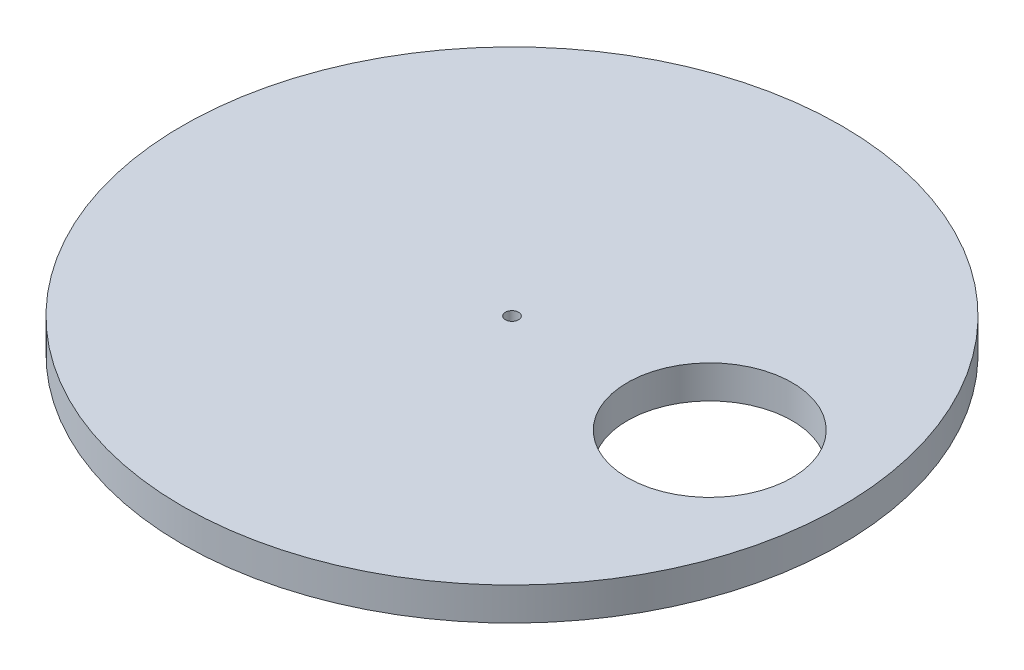
ISO-10303-21;
HEADER;
FILE_DESCRIPTION(('STEP AP214'),'2;1');
FILE_NAME('part.step','',(''),(''),'','','');
FILE_SCHEMA(('AUTOMOTIVE_DESIGN { 1 0 10303 214 1 1 1 1 }'));
ENDSEC;
DATA;
#1=APPLICATION_CONTEXT('core data for automotive mechanical design processes');
#2=APPLICATION_PROTOCOL_DEFINITION('international standard','automotive_design',2000,#1);
#3=PRODUCT_CONTEXT('',#1,'mechanical');
#4=PRODUCT('Part','Part','',(#3));
#5=PRODUCT_RELATED_PRODUCT_CATEGORY('part','',(#4));
#6=PRODUCT_DEFINITION_FORMATION('','',#4);
#7=PRODUCT_DEFINITION_CONTEXT('part definition',#1,'design');
#8=PRODUCT_DEFINITION('design','',#6,#7);
#9=PRODUCT_DEFINITION_SHAPE('','',#8);
#10=(LENGTH_UNIT() NAMED_UNIT(*) SI_UNIT(.MILLI.,.METRE.));
#11=(NAMED_UNIT(*) PLANE_ANGLE_UNIT() SI_UNIT($,.RADIAN.));
#12=(NAMED_UNIT(*) SI_UNIT($,.STERADIAN.) SOLID_ANGLE_UNIT());
#13=UNCERTAINTY_MEASURE_WITH_UNIT(LENGTH_MEASURE(1.E-05),#10,'distance_accuracy_value','');
#14=(GEOMETRIC_REPRESENTATION_CONTEXT(3) GLOBAL_UNCERTAINTY_ASSIGNED_CONTEXT((#13)) GLOBAL_UNIT_ASSIGNED_CONTEXT((#10,
#11,#12)) REPRESENTATION_CONTEXT('',''));
#15=CARTESIAN_POINT('',(0.,0.,0.));
#16=DIRECTION('',(0.,0.,1.));
#17=DIRECTION('',(1.,0.,0.));
#18=AXIS2_PLACEMENT_3D('',#15,#16,#17);
#19=CARTESIAN_POINT('',(0.,10.,0.));
#20=DIRECTION('',(0.,1.,0.));
#21=DIRECTION('',(0.,0.,1.));
#22=AXIS2_PLACEMENT_3D('',#19,#20,#21);
#23=PLANE('',#22);
#24=CARTESIAN_POINT('',(60.,10.,0.));
#25=DIRECTION('',(0.,1.,0.));
#26=DIRECTION('',(0.,0.,1.));
#27=AXIS2_PLACEMENT_3D('',#24,#25,#26);
#28=CIRCLE('',#27,25.);
#29=CARTESIAN_POINT('',(60.,10.,25.));
#30=VERTEX_POINT('',#29);
#31=EDGE_CURVE('E42',#30,#30,#28,.T.);
#32=ORIENTED_EDGE('',*,*,#31,.F.);
#33=EDGE_LOOP('',(#32));
#34=FACE_BOUND('',#33,.T.);
#35=CARTESIAN_POINT('',(0.,10.,0.));
#36=DIRECTION('',(0.,1.,0.));
#37=DIRECTION('',(0.,0.,1.));
#38=AXIS2_PLACEMENT_3D('',#35,#36,#37);
#39=CIRCLE('',#38,100.);
#40=CARTESIAN_POINT('',(0.,10.,100.));
#41=VERTEX_POINT('',#40);
#42=EDGE_CURVE('E10',#41,#41,#39,.T.);
#43=ORIENTED_EDGE('',*,*,#42,.T.);
#44=EDGE_LOOP('',(#43));
#45=FACE_BOUND('',#44,.T.);
#46=CARTESIAN_POINT('',(0.,10.,0.));
#47=DIRECTION('',(0.,1.,0.));
#48=DIRECTION('',(0.,0.,1.));
#49=AXIS2_PLACEMENT_3D('',#46,#47,#48);
#50=CIRCLE('',#49,2.);
#51=CARTESIAN_POINT('',(0.,10.,2.));
#52=VERTEX_POINT('',#51);
#53=EDGE_CURVE('E47',#52,#52,#50,.T.);
#54=ORIENTED_EDGE('',*,*,#53,.F.);
#55=EDGE_LOOP('',(#54));
#56=FACE_BOUND('',#55,.T.);
#57=ADVANCED_FACE('F31',(#34,#45,#56),#23,.T.);
#58=CARTESIAN_POINT('',(0.,0.,0.));
#59=DIRECTION('',(0.,1.,0.));
#60=DIRECTION('',(0.,0.,1.));
#61=AXIS2_PLACEMENT_3D('',#58,#59,#60);
#62=PLANE('',#61);
#63=CARTESIAN_POINT('',(0.,0.,0.));
#64=DIRECTION('',(0.,1.,0.));
#65=DIRECTION('',(0.,0.,1.));
#66=AXIS2_PLACEMENT_3D('',#63,#64,#65);
#67=CIRCLE('',#66,100.);
#68=CARTESIAN_POINT('',(0.,0.,100.));
#69=VERTEX_POINT('',#68);
#70=EDGE_CURVE('E35',#69,#69,#67,.T.);
#71=ORIENTED_EDGE('',*,*,#70,.F.);
#72=EDGE_LOOP('',(#71));
#73=FACE_BOUND('',#72,.T.);
#74=CARTESIAN_POINT('',(60.,0.,0.));
#75=DIRECTION('',(0.,1.,0.));
#76=DIRECTION('',(0.,0.,1.));
#77=AXIS2_PLACEMENT_3D('',#74,#75,#76);
#78=CIRCLE('',#77,25.);
#79=CARTESIAN_POINT('',(60.,0.,25.));
#80=VERTEX_POINT('',#79);
#81=EDGE_CURVE('E44',#80,#80,#78,.T.);
#82=ORIENTED_EDGE('',*,*,#81,.T.);
#83=EDGE_LOOP('',(#82));
#84=FACE_BOUND('',#83,.T.);
#85=CARTESIAN_POINT('',(0.,0.,0.));
#86=DIRECTION('',(0.,1.,0.));
#87=DIRECTION('',(0.,0.,1.));
#88=AXIS2_PLACEMENT_3D('',#85,#86,#87);
#89=CIRCLE('',#88,2.);
#90=CARTESIAN_POINT('',(0.,0.,2.));
#91=VERTEX_POINT('',#90);
#92=EDGE_CURVE('E50',#91,#91,#89,.T.);
#93=ORIENTED_EDGE('',*,*,#92,.T.);
#94=EDGE_LOOP('',(#93));
#95=FACE_BOUND('',#94,.T.);
#96=ADVANCED_FACE('F60',(#73,#84,#95),#62,.F.);
#97=CARTESIAN_POINT('',(0.,10.,0.));
#98=DIRECTION('',(0.,-1.,0.));
#99=DIRECTION('',(0.,0.,-1.));
#100=AXIS2_PLACEMENT_3D('',#97,#98,#99);
#101=CYLINDRICAL_SURFACE('',#100,100.);
#102=ORIENTED_EDGE('',*,*,#42,.F.);
#103=EDGE_LOOP('',(#102));
#104=FACE_BOUND('',#103,.T.);
#105=ORIENTED_EDGE('',*,*,#70,.T.);
#106=EDGE_LOOP('',(#105));
#107=FACE_BOUND('',#106,.T.);
#108=ADVANCED_FACE('F33',(#104,#107),#101,.T.);
#109=CARTESIAN_POINT('',(60.,10.,0.));
#110=DIRECTION('',(0.,-1.,0.));
#111=DIRECTION('',(0.,0.,-1.));
#112=AXIS2_PLACEMENT_3D('',#109,#110,#111);
#113=CYLINDRICAL_SURFACE('',#112,25.);
#114=ORIENTED_EDGE('',*,*,#31,.T.);
#115=EDGE_LOOP('',(#114));
#116=FACE_BOUND('',#115,.T.);
#117=ORIENTED_EDGE('',*,*,#81,.F.);
#118=EDGE_LOOP('',(#117));
#119=FACE_BOUND('',#118,.T.);
#120=ADVANCED_FACE('F69',(#116,#119),#113,.F.);
#121=CARTESIAN_POINT('',(0.,10.,0.));
#122=DIRECTION('',(0.,-1.,0.));
#123=DIRECTION('',(0.,0.,-1.));
#124=AXIS2_PLACEMENT_3D('',#121,#122,#123);
#125=CYLINDRICAL_SURFACE('',#124,2.);
#126=ORIENTED_EDGE('',*,*,#53,.T.);
#127=EDGE_LOOP('',(#126));
#128=FACE_BOUND('',#127,.T.);
#129=ORIENTED_EDGE('',*,*,#92,.F.);
#130=EDGE_LOOP('',(#129));
#131=FACE_BOUND('',#130,.T.);
#132=ADVANCED_FACE('F56',(#128,#131),#125,.F.);
#133=CLOSED_SHELL('',(#57,#96,#108,#120,#132));
#134=MANIFOLD_SOLID_BREP('B2',#133);
#135=ADVANCED_BREP_SHAPE_REPRESENTATION('',(#18,#134),#14);
#136=SHAPE_DEFINITION_REPRESENTATION(#9,#135);
ENDSEC;
END-ISO-10303-21;
